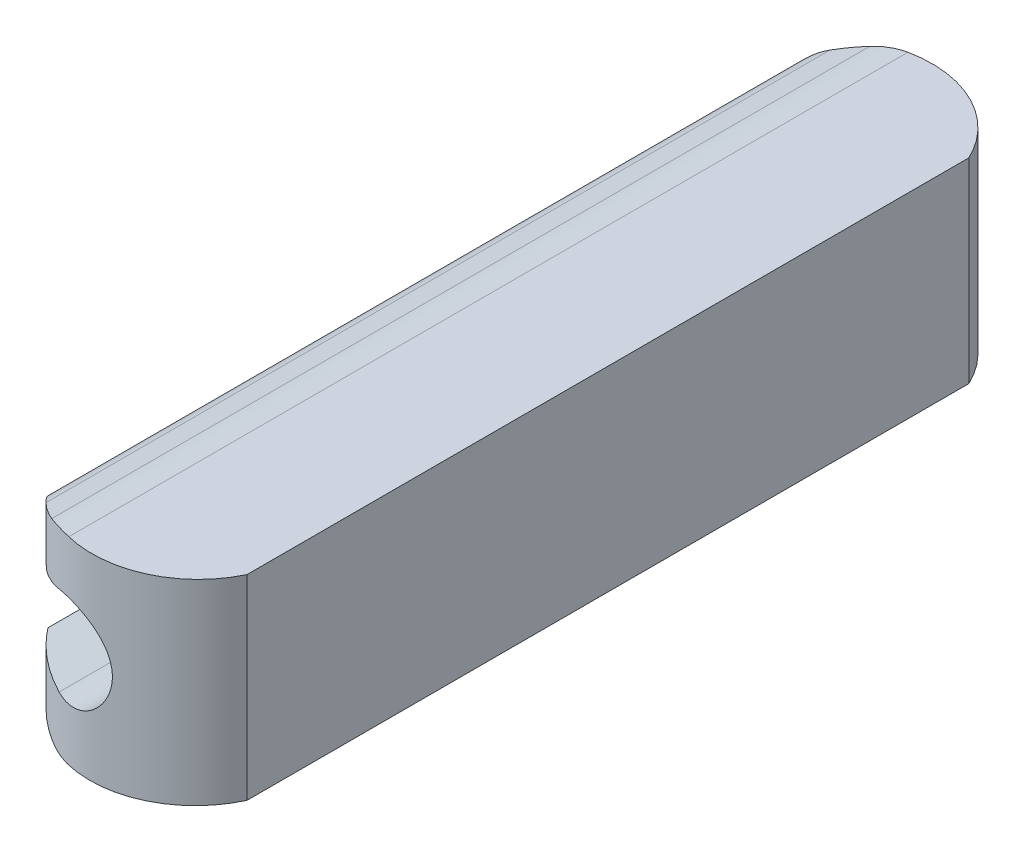
ISO-10303-21;
HEADER;
FILE_DESCRIPTION(('STEP AP214'),'2;1');
FILE_NAME('part.step','',(''),(''),'','','');
FILE_SCHEMA(('AUTOMOTIVE_DESIGN { 1 0 10303 214 1 1 1 1 }'));
ENDSEC;
DATA;
#1=APPLICATION_CONTEXT('core data for automotive mechanical design processes');
#2=APPLICATION_PROTOCOL_DEFINITION('international standard','automotive_design',2000,#1);
#3=PRODUCT_CONTEXT('',#1,'mechanical');
#4=PRODUCT('Part','Part','',(#3));
#5=PRODUCT_RELATED_PRODUCT_CATEGORY('part','',(#4));
#6=PRODUCT_DEFINITION_FORMATION('','',#4);
#7=PRODUCT_DEFINITION_CONTEXT('part definition',#1,'design');
#8=PRODUCT_DEFINITION('design','',#6,#7);
#9=PRODUCT_DEFINITION_SHAPE('','',#8);
#10=(LENGTH_UNIT() NAMED_UNIT(*) SI_UNIT(.MILLI.,.METRE.));
#11=(NAMED_UNIT(*) PLANE_ANGLE_UNIT() SI_UNIT($,.RADIAN.));
#12=(NAMED_UNIT(*) SI_UNIT($,.STERADIAN.) SOLID_ANGLE_UNIT());
#13=UNCERTAINTY_MEASURE_WITH_UNIT(LENGTH_MEASURE(1.E-05),#10,'distance_accuracy_value','');
#14=(GEOMETRIC_REPRESENTATION_CONTEXT(3) GLOBAL_UNCERTAINTY_ASSIGNED_CONTEXT((#13)) GLOBAL_UNIT_ASSIGNED_CONTEXT((#10,
#11,#12)) REPRESENTATION_CONTEXT('',''));
#15=CARTESIAN_POINT('',(0.,0.,0.));
#16=DIRECTION('',(0.,0.,1.));
#17=DIRECTION('',(1.,0.,0.));
#18=AXIS2_PLACEMENT_3D('',#15,#16,#17);
#19=CARTESIAN_POINT('',(-2.45293322950602,-1.69036477014939,16.));
#20=DIRECTION('',(-0.258821432514505,-0.965925186580793,0.));
#21=DIRECTION('',(0.965925186580793,-0.258821432514505,0.));
#22=AXIS2_PLACEMENT_3D('',#19,#20,#21);
#23=PLANE('',#22);
#24=DIRECTION('',(0.,0.,-1.));
#25=VECTOR('',#24,1.);
#26=CARTESIAN_POINT('',(-2.45293322950602,-1.69036477014939,16.));
#27=LINE('',#26,#25);
#28=CARTESIAN_POINT('',(-2.45293322950602,-1.69036477014939,15.7388461950632));
#29=VERTEX_POINT('',#28);
#30=CARTESIAN_POINT('',(-2.45293322950602,-1.69036477014939,-15.7388461950631));
#31=VERTEX_POINT('',#30);
#32=EDGE_CURVE('E170',#29,#31,#27,.T.);
#33=ORIENTED_EDGE('',*,*,#32,.T.);
#34=CARTESIAN_POINT('',(-1.030884728903,-2.07140528461618,-11.9977162722063));
#35=DIRECTION('',(-0.258821432514505,-0.965925186580793,0.));
#36=DIRECTION('',(-0.965925186580793,0.258821432514505,0.));
#37=AXIS2_PLACEMENT_3D('',#34,#35,#36);
#38=ELLIPSE('',#37,4.14347175474436,4.00228372779369);
#39=CARTESIAN_POINT('',(-4.28299140657226,-1.19999731151645,-14.3305422826111));
#40=VERTEX_POINT('',#39);
#41=EDGE_CURVE('E273',#31,#40,#38,.F.);
#42=ORIENTED_EDGE('',*,*,#41,.T.);
#43=DIRECTION('',(0.,0.,-1.));
#44=VECTOR('',#43,1.);
#45=CARTESIAN_POINT('',(-4.28299140657226,-1.19999731151645,16.));
#46=LINE('',#45,#44);
#47=CARTESIAN_POINT('',(-4.28299140657226,-1.19999731151645,14.3305422826111));
#48=VERTEX_POINT('',#47);
#49=EDGE_CURVE('E190',#48,#40,#46,.T.);
#50=ORIENTED_EDGE('',*,*,#49,.F.);
#51=CARTESIAN_POINT('',(-1.030884728903,-2.07140528461618,11.9977162722063));
#52=DIRECTION('',(-0.258821432514505,-0.965925186580793,0.));
#53=DIRECTION('',(-0.965925186580793,0.258821432514505,0.));
#54=AXIS2_PLACEMENT_3D('',#51,#52,#53);
#55=ELLIPSE('',#54,4.14347175474436,4.00228372779369);
#56=EDGE_CURVE('E320',#48,#29,#55,.F.);
#57=ORIENTED_EDGE('',*,*,#56,.T.);
#58=EDGE_LOOP('',(#33,#42,#50,#57));
#59=FACE_BOUND('',#58,.T.);
#60=ADVANCED_FACE('F38',(#59),#23,.F.);
#61=CARTESIAN_POINT('',(-4.80063427160127,-3.13184768467804,16.));
#62=DIRECTION('',(-0.965925186580793,0.258821432514504,0.));
#63=DIRECTION('',(-0.258821432514505,-0.965925186580793,0.));
#64=AXIS2_PLACEMENT_3D('',#61,#62,#63);
#65=PLANE('',#64);
#66=CARTESIAN_POINT('',(-1.030884728903,10.9369100492458,-11.9977162722063));
#67=DIRECTION('',(-0.965925186580793,0.258821432514504,0.));
#68=DIRECTION('',(0.258821432514505,0.965925186580793,0.));
#69=AXIS2_PLACEMENT_3D('',#66,#67,#68);
#70=ELLIPSE('',#69,15.4634942280887,4.00228372779369);
#71=CARTESIAN_POINT('',(-4.54181283908676,-2.16592249809725,-13.9190852744762));
#72=VERTEX_POINT('',#71);
#73=EDGE_CURVE('E271',#72,#40,#70,.F.);
#74=ORIENTED_EDGE('',*,*,#73,.F.);
#75=DIRECTION('',(0.,0.,-1.));
#76=VECTOR('',#75,1.);
#77=CARTESIAN_POINT('',(-4.54181283908676,-2.16592249809725,16.));
#78=LINE('',#77,#76);
#79=CARTESIAN_POINT('',(-4.54181283908676,-2.16592249809725,13.9190852744762));
#80=VERTEX_POINT('',#79);
#81=EDGE_CURVE('E196',#72,#80,#78,.F.);
#82=ORIENTED_EDGE('',*,*,#81,.T.);
#83=CARTESIAN_POINT('',(-1.030884728903,10.9369100492458,11.9977162722063));
#84=DIRECTION('',(-0.965925186580793,0.258821432514504,0.));
#85=DIRECTION('',(0.258821432514505,0.965925186580793,0.));
#86=AXIS2_PLACEMENT_3D('',#83,#84,#85);
#87=ELLIPSE('',#86,15.4634942280887,4.00228372779369);
#88=EDGE_CURVE('E322',#48,#80,#87,.F.);
#89=ORIENTED_EDGE('',*,*,#88,.F.);
#90=ORIENTED_EDGE('',*,*,#49,.T.);
#91=EDGE_LOOP('',(#74,#82,#89,#90));
#92=FACE_BOUND('',#91,.T.);
#93=ADVANCED_FACE('F338',(#92),#65,.T.);
#94=CARTESIAN_POINT('',(-2.97057609453502,-3.62221514331097,16.));
#95=DIRECTION('',(-0.258821432514505,-0.965925186580793,0.));
#96=DIRECTION('',(0.965925186580793,-0.258821432514505,0.));
#97=AXIS2_PLACEMENT_3D('',#94,#95,#96);
#98=PLANE('',#97);
#99=CARTESIAN_POINT('',(-1.030884728903,-4.14195901671178,-11.9977162722063));
#100=DIRECTION('',(-0.258821432514505,-0.965925186580793,0.));
#101=DIRECTION('',(-0.965925186580793,0.258821432514505,0.));
#102=AXIS2_PLACEMENT_3D('',#99,#100,#101);
#103=ELLIPSE('',#102,4.14347175474436,4.00228372779369);
#104=CARTESIAN_POINT('',(-2.97057609453502,-3.62221514331097,-15.49855509224));
#105=VERTEX_POINT('',#104);
#106=CARTESIAN_POINT('',(-3.83470908502047,-3.39066911719254,-14.8537351828238));
#107=VERTEX_POINT('',#106);
#108=EDGE_CURVE('E262',#105,#107,#103,.F.);
#109=ORIENTED_EDGE('',*,*,#108,.F.);
#110=DIRECTION('',(0.,0.,-1.));
#111=VECTOR('',#110,1.);
#112=CARTESIAN_POINT('',(-2.97057609453502,-3.62221514331097,16.));
#113=LINE('',#112,#111);
#114=CARTESIAN_POINT('',(-2.97057609453502,-3.62221514331097,15.49855509224));
#115=VERTEX_POINT('',#114);
#116=EDGE_CURVE('E187',#115,#105,#113,.T.);
#117=ORIENTED_EDGE('',*,*,#116,.F.);
#118=CARTESIAN_POINT('',(-1.030884728903,-4.14195901671178,11.9977162722063));
#119=DIRECTION('',(-0.258821432514505,-0.965925186580793,0.));
#120=DIRECTION('',(-0.965925186580793,0.258821432514505,0.));
#121=AXIS2_PLACEMENT_3D('',#118,#119,#120);
#122=ELLIPSE('',#121,4.14347175474436,4.00228372779369);
#123=CARTESIAN_POINT('',(-3.83470908502047,-3.39066911719254,14.8537351828238));
#124=VERTEX_POINT('',#123);
#125=EDGE_CURVE('E244',#124,#115,#122,.F.);
#126=ORIENTED_EDGE('',*,*,#125,.F.);
#127=DIRECTION('',(0.,0.,-1.));
#128=VECTOR('',#127,1.);
#129=CARTESIAN_POINT('',(-3.83470908502047,-3.39066911719254,16.));
#130=LINE('',#129,#128);
#131=EDGE_CURVE('E193',#124,#107,#130,.T.);
#132=ORIENTED_EDGE('',*,*,#131,.T.);
#133=EDGE_LOOP('',(#109,#117,#126,#132));
#134=FACE_BOUND('',#133,.T.);
#135=ADVANCED_FACE('F291',(#134),#98,.T.);
#136=CARTESIAN_POINT('',(-2.97057609453502,3.62222052027807,16.));
#137=DIRECTION('',(-0.258821432514505,0.965925186580793,0.));
#138=DIRECTION('',(-0.965925186580793,-0.258821432514505,0.));
#139=AXIS2_PLACEMENT_3D('',#136,#137,#138);
#140=PLANE('',#139);
#141=CARTESIAN_POINT('',(-1.030884728903,4.14196439367887,-11.9977162722063));
#142=DIRECTION('',(-0.258821432514505,0.965925186580793,0.));
#143=DIRECTION('',(0.965925186580793,0.258821432514505,0.));
#144=AXIS2_PLACEMENT_3D('',#141,#142,#143);
#145=ELLIPSE('',#144,4.14347175474436,4.00228372779369);
#146=CARTESIAN_POINT('',(-3.83470908502047,3.39067449415964,-14.8537351828238));
#147=VERTEX_POINT('',#146);
#148=CARTESIAN_POINT('',(-2.97057499451313,3.62222081503063,-15.4985557017231));
#149=VERTEX_POINT('',#148);
#150=EDGE_CURVE('E309',#147,#149,#145,.F.);
#151=ORIENTED_EDGE('',*,*,#150,.F.);
#152=DIRECTION('',(0.,0.,-1.));
#153=VECTOR('',#152,1.);
#154=CARTESIAN_POINT('',(-3.83470908502047,3.39067449415964,16.));
#155=LINE('',#154,#153);
#156=CARTESIAN_POINT('',(-3.83470908502047,3.39067449415964,14.8537351828238));
#157=VERTEX_POINT('',#156);
#158=EDGE_CURVE('E202',#147,#157,#155,.F.);
#159=ORIENTED_EDGE('',*,*,#158,.T.);
#160=CARTESIAN_POINT('',(-1.030884728903,4.14196439367887,11.9977162722063));
#161=DIRECTION('',(-0.258821432514505,0.965925186580793,0.));
#162=DIRECTION('',(0.965925186580793,0.258821432514505,0.));
#163=AXIS2_PLACEMENT_3D('',#160,#161,#162);
#164=ELLIPSE('',#163,4.14347175474436,4.00228372779369);
#165=CARTESIAN_POINT('',(-2.97057499451313,3.62222081503063,15.4985557017231));
#166=VERTEX_POINT('',#165);
#167=EDGE_CURVE('E66',#166,#157,#164,.F.);
#168=ORIENTED_EDGE('',*,*,#167,.F.);
#169=DIRECTION('',(0.,0.,-1.));
#170=VECTOR('',#169,1.);
#171=CARTESIAN_POINT('',(-2.97057499451313,3.62222081503063,16.));
#172=LINE('',#171,#170);
#173=EDGE_CURVE('E184',#166,#149,#172,.T.);
#174=ORIENTED_EDGE('',*,*,#173,.T.);
#175=EDGE_LOOP('',(#151,#159,#168,#174));
#176=FACE_BOUND('',#175,.T.);
#177=ADVANCED_FACE('F289',(#176),#140,.T.);
#178=CARTESIAN_POINT('',(-4.28299140657226,1.20000268848355,16.));
#179=DIRECTION('',(-0.965925186580793,-0.258821432514504,0.));
#180=DIRECTION('',(0.258821432514504,-0.965925186580793,0.));
#181=AXIS2_PLACEMENT_3D('',#178,#179,#180);
#182=PLANE('',#181);
#183=CARTESIAN_POINT('',(-1.030884728903,-10.9369046722787,-11.9977162722063));
#184=DIRECTION('',(-0.965925186580793,-0.258821432514504,0.));
#185=DIRECTION('',(-0.258821432514504,0.965925186580793,0.));
#186=AXIS2_PLACEMENT_3D('',#183,#184,#185);
#187=ELLIPSE('',#186,15.4634942280887,4.00228372779369);
#188=CARTESIAN_POINT('',(-4.28299140657226,1.20000268848355,-14.3305422826111));
#189=VERTEX_POINT('',#188);
#190=CARTESIAN_POINT('',(-4.54181283908676,2.16592787506434,-13.9190852744762));
#191=VERTEX_POINT('',#190);
#192=EDGE_CURVE('E58',#189,#191,#187,.F.);
#193=ORIENTED_EDGE('',*,*,#192,.F.);
#194=DIRECTION('',(0.,0.,-1.));
#195=VECTOR('',#194,1.);
#196=CARTESIAN_POINT('',(-4.28299140657226,1.20000268848355,16.));
#197=LINE('',#196,#195);
#198=CARTESIAN_POINT('',(-4.28299140657226,1.20000268848355,14.3305422826111));
#199=VERTEX_POINT('',#198);
#200=EDGE_CURVE('E181',#199,#189,#197,.T.);
#201=ORIENTED_EDGE('',*,*,#200,.F.);
#202=CARTESIAN_POINT('',(-1.030884728903,-10.9369046722787,11.9977162722063));
#203=DIRECTION('',(-0.965925186580793,-0.258821432514504,0.));
#204=DIRECTION('',(-0.258821432514504,0.965925186580793,0.));
#205=AXIS2_PLACEMENT_3D('',#202,#203,#204);
#206=ELLIPSE('',#205,15.4634942280887,4.00228372779369);
#207=CARTESIAN_POINT('',(-4.54181283908676,2.16592787506434,13.9190852744762));
#208=VERTEX_POINT('',#207);
#209=EDGE_CURVE('E346',#208,#199,#206,.F.);
#210=ORIENTED_EDGE('',*,*,#209,.F.);
#211=DIRECTION('',(0.,0.,-1.));
#212=VECTOR('',#211,1.);
#213=CARTESIAN_POINT('',(-4.54181283908676,2.16592787506434,16.));
#214=LINE('',#213,#212);
#215=EDGE_CURVE('E199',#208,#191,#214,.T.);
#216=ORIENTED_EDGE('',*,*,#215,.T.);
#217=EDGE_LOOP('',(#193,#201,#210,#216));
#218=FACE_BOUND('',#217,.T.);
#219=ADVANCED_FACE('F355',(#218),#182,.T.);
#220=CARTESIAN_POINT('',(-2.45293322950602,1.69037014711648,16.));
#221=DIRECTION('',(-0.258821432514505,0.965925186580793,0.));
#222=DIRECTION('',(-0.965925186580793,-0.258821432514505,0.));
#223=AXIS2_PLACEMENT_3D('',#220,#221,#222);
#224=PLANE('',#223);
#225=ORIENTED_EDGE('',*,*,#200,.T.);
#226=CARTESIAN_POINT('',(-1.030884728903,2.07141066158327,-11.9977162722063));
#227=DIRECTION('',(-0.258821432514505,0.965925186580793,0.));
#228=DIRECTION('',(0.965925186580793,0.258821432514505,0.));
#229=AXIS2_PLACEMENT_3D('',#226,#227,#228);
#230=ELLIPSE('',#229,4.14347175474436,4.00228372779369);
#231=CARTESIAN_POINT('',(-2.45293322950602,1.69037014711648,-15.7388461950631));
#232=VERTEX_POINT('',#231);
#233=EDGE_CURVE('E308',#189,#232,#230,.F.);
#234=ORIENTED_EDGE('',*,*,#233,.T.);
#235=DIRECTION('',(0.,0.,-1.));
#236=VECTOR('',#235,1.);
#237=CARTESIAN_POINT('',(-2.45293322950602,1.69037014711648,16.));
#238=LINE('',#237,#236);
#239=CARTESIAN_POINT('',(-2.45293322950602,1.69037014711648,15.7388461950632));
#240=VERTEX_POINT('',#239);
#241=EDGE_CURVE('E178',#240,#232,#238,.T.);
#242=ORIENTED_EDGE('',*,*,#241,.F.);
#243=CARTESIAN_POINT('',(-1.030884728903,2.07141066158327,11.9977162722063));
#244=DIRECTION('',(-0.258821432514505,0.965925186580793,0.));
#245=DIRECTION('',(0.965925186580793,0.258821432514505,0.));
#246=AXIS2_PLACEMENT_3D('',#243,#244,#245);
#247=ELLIPSE('',#246,4.14347175474436,4.00228372779369);
#248=EDGE_CURVE('E245',#240,#199,#247,.F.);
#249=ORIENTED_EDGE('',*,*,#248,.T.);
#250=EDGE_LOOP('',(#225,#234,#242,#249));
#251=FACE_BOUND('',#250,.T.);
#252=ADVANCED_FACE('F354',(#251),#224,.F.);
#253=CARTESIAN_POINT('',(0.,-3.74999536955267,16.));
#254=DIRECTION('',(0.,-1.,0.));
#255=DIRECTION('',(1.,0.,0.));
#256=AXIS2_PLACEMENT_3D('',#253,#254,#255);
#257=PLANE('',#256);
#258=CARTESIAN_POINT('',(-1.030884728903,-3.74999536955275,-11.9977162722063));
#259=DIRECTION('',(0.,-1.,0.));
#260=DIRECTION('',(0.,0.,-1.));
#261=AXIS2_PLACEMENT_3D('',#258,#259,#260);
#262=CIRCLE('',#261,4.00228372779369);
#263=CARTESIAN_POINT('',(-1.99999718774555,-3.74999536955275,-15.8808974526148));
#264=VERTEX_POINT('',#263);
#265=CARTESIAN_POINT('',(2.60276571840215,-3.74999536955275,-13.6754705642769));
#266=VERTEX_POINT('',#265);
#267=EDGE_CURVE('E153',#264,#266,#262,.T.);
#268=ORIENTED_EDGE('',*,*,#267,.T.);
#269=DIRECTION('',(0.,0.,-1.));
#270=VECTOR('',#269,1.);
#271=CARTESIAN_POINT('',(2.60276571840215,-3.74999536955267,16.));
#272=LINE('',#271,#270);
#273=CARTESIAN_POINT('',(2.60276571840215,-3.74999536955275,13.6754705642769));
#274=VERTEX_POINT('',#273);
#275=EDGE_CURVE('E160',#274,#266,#272,.T.);
#276=ORIENTED_EDGE('',*,*,#275,.F.);
#277=CARTESIAN_POINT('',(-1.030884728903,-3.74999536955275,11.9977162722063));
#278=DIRECTION('',(0.,-1.,0.));
#279=DIRECTION('',(0.,0.,1.));
#280=AXIS2_PLACEMENT_3D('',#277,#278,#279);
#281=CIRCLE('',#280,4.00228372779369);
#282=CARTESIAN_POINT('',(-1.99999718774555,-3.74999536955275,15.8808974526148));
#283=VERTEX_POINT('',#282);
#284=EDGE_CURVE('E142',#274,#283,#281,.T.);
#285=ORIENTED_EDGE('',*,*,#284,.T.);
#286=DIRECTION('',(0.,0.,-1.));
#287=VECTOR('',#286,1.);
#288=CARTESIAN_POINT('',(-1.99999718774555,-3.74999536955267,16.));
#289=LINE('',#288,#287);
#290=EDGE_CURVE('E168',#283,#264,#289,.T.);
#291=ORIENTED_EDGE('',*,*,#290,.T.);
#292=EDGE_LOOP('',(#268,#276,#285,#291));
#293=FACE_BOUND('',#292,.T.);
#294=ADVANCED_FACE('F167',(#293),#257,.T.);
#295=CARTESIAN_POINT('',(0.0733858378657422,3.709718651575,16.));
#296=DIRECTION('',(-0.0197781799508234,-0.999804392667802,0.));
#297=DIRECTION('',(0.999804392667802,-0.0197781799508234,0.));
#298=AXIS2_PLACEMENT_3D('',#295,#296,#297);
#299=PLANE('',#298);
#300=DIRECTION('',(0.,0.,-1.));
#301=VECTOR('',#300,1.);
#302=CARTESIAN_POINT('',(2.60276571840215,3.6596823336631,16.));
#303=LINE('',#302,#301);
#304=CARTESIAN_POINT('',(2.60276571840215,3.6596823336631,13.6754705642769));
#305=VERTEX_POINT('',#304);
#306=CARTESIAN_POINT('',(2.60276571840215,3.6596823336631,-13.6754705642769));
#307=VERTEX_POINT('',#306);
#308=EDGE_CURVE('E162',#305,#307,#303,.T.);
#309=ORIENTED_EDGE('',*,*,#308,.T.);
#310=CARTESIAN_POINT('',(-1.030884728903,3.73156338654928,-11.9977162722063));
#311=DIRECTION('',(-0.0197781799508234,-0.999804392667802,0.));
#312=DIRECTION('',(-0.999804392667802,0.0197781799508234,0.));
#313=AXIS2_PLACEMENT_3D('',#310,#311,#312);
#314=ELLIPSE('',#313,4.00306675700264,4.00228372779369);
#315=CARTESIAN_POINT('',(-1.92582905133847,3.74926721940396,-15.8986584273148));
#316=VERTEX_POINT('',#315);
#317=EDGE_CURVE('E313',#307,#316,#314,.F.);
#318=ORIENTED_EDGE('',*,*,#317,.T.);
#319=DIRECTION('',(0.,0.,-1.));
#320=VECTOR('',#319,1.);
#321=CARTESIAN_POINT('',(-1.92582905133847,3.74926721940389,16.));
#322=LINE('',#321,#320);
#323=CARTESIAN_POINT('',(-1.92582905133847,3.74926721940396,15.8986584273148));
#324=VERTEX_POINT('',#323);
#325=EDGE_CURVE('E172',#324,#316,#322,.T.);
#326=ORIENTED_EDGE('',*,*,#325,.F.);
#327=CARTESIAN_POINT('',(-1.030884728903,3.73156338654928,11.9977162722063));
#328=DIRECTION('',(-0.0197781799508234,-0.999804392667802,0.));
#329=DIRECTION('',(-0.999804392667802,0.0197781799508234,0.));
#330=AXIS2_PLACEMENT_3D('',#327,#328,#329);
#331=ELLIPSE('',#330,4.00306675700264,4.00228372779369);
#332=EDGE_CURVE('E164',#324,#305,#331,.F.);
#333=ORIENTED_EDGE('',*,*,#332,.T.);
#334=EDGE_LOOP('',(#309,#318,#326,#333));
#335=FACE_BOUND('',#334,.T.);
#336=ADVANCED_FACE('F214',(#335),#299,.F.);
#337=CARTESIAN_POINT('',(-1.99999718774555,2.68848354670792E-06,16.));
#338=DIRECTION('',(0.,0.,-1.));
#339=DIRECTION('',(-1.,0.,0.));
#340=AXIS2_PLACEMENT_3D('',#337,#338,#339);
#341=CYLINDRICAL_SURFACE('',#340,3.7499980580363);
#342=CARTESIAN_POINT('',(-1.99999718774555,-3.74999536955275,-15.8808974526148));
#343=CARTESIAN_POINT('',(-2.08575228189416,-3.7500113364589,-15.859514687352));
#344=CARTESIAN_POINT('',(-2.17076027349519,-3.74705452271607,-15.8352639264582));
#345=CARTESIAN_POINT('',(-2.33803142329213,-3.73565805022022,-15.781532231521));
#346=CARTESIAN_POINT('',(-2.42031036239841,-3.72725959030275,-15.7520917979917));
#347=CARTESIAN_POINT('',(-2.58216103520052,-3.70543182184758,-15.6881625878047));
#348=CARTESIAN_POINT('',(-2.66173322552486,-3.6920033665075,-15.6536746679155));
#349=CARTESIAN_POINT('',(-2.81834556260527,-3.66049371823136,-15.5797315005388));
#350=CARTESIAN_POINT('',(-2.89536209095974,-3.64237820352151,-15.5402407565357));
#351=CARTESIAN_POINT('',(-2.97057609453506,-3.62221514331112,-15.49855509224));
#352=B_SPLINE_CURVE_WITH_KNOTS('',3,(#342,#343,#344,#345,#346,#347,#348,#349,#350,#351),
.UNSPECIFIED.,.F.,.F.,(4,2,2,2,4),(0.,0.264998894754735,0.528014556403104,0.790985625010632,
1.05593970592983),.UNSPECIFIED.);
#353=EDGE_CURVE('E276',#264,#105,#352,.T.);
#354=ORIENTED_EDGE('',*,*,#353,.F.);
#355=ORIENTED_EDGE('',*,*,#290,.F.);
#356=CARTESIAN_POINT('',(-2.97057609453506,-3.62221514331112,15.49855509224));
#357=CARTESIAN_POINT('',(-2.89536209095974,-3.64237820352151,15.5402407565357));
#358=CARTESIAN_POINT('',(-2.81834556260527,-3.66049371823136,15.5797315005388));
#359=CARTESIAN_POINT('',(-2.66173322552486,-3.6920033665075,15.6536746679155));
#360=CARTESIAN_POINT('',(-2.58216103520052,-3.70543182184758,15.6881625878047));
#361=CARTESIAN_POINT('',(-2.42031036239841,-3.72725959030275,15.7520917979917));
#362=CARTESIAN_POINT('',(-2.33803142329213,-3.73565805022022,15.781532231521));
#363=CARTESIAN_POINT('',(-2.17076027349519,-3.74705452271607,15.8352639264582));
#364=CARTESIAN_POINT('',(-2.08575228189416,-3.7500113364589,15.859514687352));
#365=CARTESIAN_POINT('',(-1.99999718774555,-3.74999536955275,15.8808974526148));
#366=B_SPLINE_CURVE_WITH_KNOTS('',3,(#356,#357,#358,#359,#360,#361,#362,#363,#364,#365),
.UNSPECIFIED.,.F.,.F.,(4,2,2,2,4),(0.,0.2649540809192,0.527925149526728,0.790940811175095,
1.05593970592983),.UNSPECIFIED.);
#367=EDGE_CURVE('E148',#115,#283,#366,.T.);
#368=ORIENTED_EDGE('',*,*,#367,.F.);
#369=ORIENTED_EDGE('',*,*,#116,.T.);
#370=EDGE_LOOP('',(#354,#355,#368,#369));
#371=FACE_BOUND('',#370,.T.);
#372=ADVANCED_FACE('F287',(#371),#341,.T.);
#373=CARTESIAN_POINT('',(-2.97057499451313,3.62222081503063,-15.4985557017231));
#374=CARTESIAN_POINT('',(-2.88988851884182,3.6438536075663,-15.5432778691023));
#375=CARTESIAN_POINT('',(-2.80712000587584,3.66312787703783,-15.5854728629984));
#376=CARTESIAN_POINT('',(-2.63870875349587,3.69619170563301,-15.6640098538193));
#377=CARTESIAN_POINT('',(-2.55309727156406,3.71002750730656,-15.70039956261));
#378=CARTESIAN_POINT('',(-2.37884915037511,3.73184639310836,-15.7673274314034));
#379=CARTESIAN_POINT('',(-2.29021189344988,3.73982827467581,-15.7978643881341));
#380=CARTESIAN_POINT('',(-2.10991819175405,3.74949179532305,-15.8529696045095));
#381=CARTESIAN_POINT('',(-2.01824208222298,3.75111755051414,-15.8774831529747));
#382=CARTESIAN_POINT('',(-1.92582905133847,3.74926721940396,-15.8986584273148));
#383=B_SPLINE_CURVE_WITH_KNOTS('',3,(#373,#374,#375,#376,#377,#378,#379,#380,#381,#382),
.UNSPECIFIED.,.F.,.F.,(4,2,2,2,4),(0.,0.284238888640319,0.566005757874163,0.847830493793274,
1.1321275701048),.UNSPECIFIED.);
#384=EDGE_CURVE('E301',#149,#316,#383,.T.);
#385=ORIENTED_EDGE('',*,*,#384,.F.);
#386=ORIENTED_EDGE('',*,*,#173,.F.);
#387=CARTESIAN_POINT('',(-1.92582905133847,3.74926721940396,15.8986584273148));
#388=CARTESIAN_POINT('',(-2.01824208222298,3.75111755051414,15.8774831529747));
#389=CARTESIAN_POINT('',(-2.10991819175405,3.74949179532305,15.8529696045095));
#390=CARTESIAN_POINT('',(-2.29021189344988,3.73982827467581,15.7978643881341));
#391=CARTESIAN_POINT('',(-2.37884915037511,3.73184639310836,15.7673274314034));
#392=CARTESIAN_POINT('',(-2.55309727156406,3.71002750730656,15.70039956261));
#393=CARTESIAN_POINT('',(-2.63870875349587,3.69619170563301,15.6640098538193));
#394=CARTESIAN_POINT('',(-2.80712000587584,3.66312787703783,15.5854728629984));
#395=CARTESIAN_POINT('',(-2.88988851884182,3.6438536075663,15.5432778691023));
#396=CARTESIAN_POINT('',(-2.97057499451313,3.62222081503063,15.4985557017231));
#397=B_SPLINE_CURVE_WITH_KNOTS('',3,(#387,#388,#389,#390,#391,#392,#393,#394,#395,#396),
.UNSPECIFIED.,.F.,.F.,(4,2,2,2,4),(0.,0.284297076311523,0.566121812230634,0.847888681464477,
1.1321275701048),.UNSPECIFIED.);
#398=EDGE_CURVE('E222',#324,#166,#397,.T.);
#399=ORIENTED_EDGE('',*,*,#398,.F.);
#400=ORIENTED_EDGE('',*,*,#325,.T.);
#401=EDGE_LOOP('',(#385,#386,#399,#400));
#402=FACE_BOUND('',#401,.T.);
#403=ADVANCED_FACE('F281',(#402),#341,.T.);
#404=CARTESIAN_POINT('',(-1.99999718774555,2.68848354670792E-06,16.));
#405=DIRECTION('',(0.,0.,-1.));
#406=DIRECTION('',(-1.,0.,0.));
#407=AXIS2_PLACEMENT_3D('',#404,#405,#406);
#408=CYLINDRICAL_SURFACE('',#407,1.7499980580363);
#409=ORIENTED_EDGE('',*,*,#241,.T.);
#410=CARTESIAN_POINT('',(-2.45293322950602,1.69037014711648,-15.7388461950632));
#411=CARTESIAN_POINT('',(-2.40947616231862,1.70201282000994,-15.7553671266546));
#412=CARTESIAN_POINT('',(-2.36536355892049,1.71203677797308,-15.7712646269125));
#413=CARTESIAN_POINT('',(-2.2760150016433,1.728695142162,-15.8016818256895));
#414=CARTESIAN_POINT('',(-2.2307785291928,1.73532795201225,-15.8162008726907));
#415=CARTESIAN_POINT('',(-2.09370101823686,1.74989982527703,-15.8574791986698));
#416=CARTESIAN_POINT('',(-2.00051740144378,1.75250537836398,-15.8819498933717));
#417=CARTESIAN_POINT('',(-1.81311781534035,1.74253121284984,-15.9239926639164));
#418=CARTESIAN_POINT('',(-1.71889956367207,1.72990513778091,-15.9415434633813));
#419=CARTESIAN_POINT('',(-1.53288096734242,1.68918621441179,-15.9695049035471));
#420=CARTESIAN_POINT('',(-1.4410775858084,1.66111387144292,-15.9799249694275));
#421=CARTESIAN_POINT('',(-1.26702338866354,1.59173688744482,-15.9939391927525));
#422=CARTESIAN_POINT('',(-1.18452726410193,1.55110245627986,-15.9978260804001));
#423=CARTESIAN_POINT('',(-1.02682550366313,1.45734670716957,-16.0007761482736));
#424=CARTESIAN_POINT('',(-0.951624274635816,1.40421790690988,-15.9998364310084));
#425=CARTESIAN_POINT('',(-0.8093174346822,1.28588387022236,-15.9945088315238));
#426=CARTESIAN_POINT('',(-0.742377094321925,1.22048302732012,-15.990060713805));
#427=CARTESIAN_POINT('',(-0.619822109368743,1.07995914401661,-15.9793107326707));
#428=CARTESIAN_POINT('',(-0.564208532775998,1.00483518791455,-15.9730086945859));
#429=CARTESIAN_POINT('',(-0.463299989561277,0.842958002615447,-15.9598926428827));
#430=CARTESIAN_POINT('',(-0.418617858894432,0.755822683641738,-15.9530685141595));
#431=CARTESIAN_POINT('',(-0.344360530747043,0.575235028861775,-15.9408602113655));
#432=CARTESIAN_POINT('',(-0.314785814437687,0.481782491959443,-15.9354760831612));
#433=CARTESIAN_POINT('',(-0.271481859403842,0.290520218339105,-15.9273572231979));
#434=CARTESIAN_POINT('',(-0.257855199772028,0.192686431803869,-15.9246396608478));
#435=CARTESIAN_POINT('',(-0.247237532760858,-0.00390786046223566,-15.9225352203633));
#436=CARTESIAN_POINT('',(-0.250244538671093,-0.10266825411336,-15.9231479444623));
#437=CARTESIAN_POINT('',(-0.272587036157358,-0.296468712118606,-15.9275230174692));
#438=CARTESIAN_POINT('',(-0.291632834130352,-0.391543682049042,-15.9312294767406));
#439=CARTESIAN_POINT('',(-0.345091069667042,-0.57715344819577,-15.9408994141398));
#440=CARTESIAN_POINT('',(-0.379505646312738,-0.66768761045433,-15.9468632064336));
#441=CARTESIAN_POINT('',(-0.463161638354881,-0.842690884943185,-15.9597569896667));
#442=CARTESIAN_POINT('',(-0.512550831000325,-0.927088645029999,-15.9666962227722));
#443=CARTESIAN_POINT('',(-0.624718606213788,-1.08655409532266,-15.9797362500696));
#444=CARTESIAN_POINT('',(-0.687498718270331,-1.16162071819005,-15.9858369483545));
#445=CARTESIAN_POINT('',(-0.825507407565935,-1.30106820188767,-15.9953303305044));
#446=CARTESIAN_POINT('',(-0.900857340781638,-1.36533125796159,-15.998694526125));
#447=CARTESIAN_POINT('',(-1.06134968722476,-1.48025566648844,-16.0006862627049));
#448=CARTESIAN_POINT('',(-1.14648818432012,-1.53092243157742,-15.999315691582));
#449=CARTESIAN_POINT('',(-1.32048475473683,-1.61547199134618,-15.9904224391499));
#450=CARTESIAN_POINT('',(-1.40908286875975,-1.64991389652562,-15.9831328527929));
#451=CARTESIAN_POINT('',(-1.58994085667921,-1.70388909480428,-15.9618062545628));
#452=CARTESIAN_POINT('',(-1.68220054035809,-1.72342316129841,-15.9477695927787));
#453=CARTESIAN_POINT('',(-1.86393903653007,-1.74701801403,-15.9133959897707));
#454=CARTESIAN_POINT('',(-1.95339692442204,-1.75161581687856,-15.8933068053384));
#455=CARTESIAN_POINT('',(-2.13035736984316,-1.74737253413396,-15.8471033048749));
#456=CARTESIAN_POINT('',(-2.21786151655,-1.73854280706467,-15.8209940971067));
#457=CARTESIAN_POINT('',(-2.32863736267034,-1.71905365699092,-15.7838535686245));
#458=CARTESIAN_POINT('',(-2.35379848975327,-1.71404924090396,-15.7751334935713));
#459=CARTESIAN_POINT('',(-2.40368466651899,-1.70298848562102,-15.7572896852942));
#460=CARTESIAN_POINT('',(-2.42841048656521,-1.69693426662493,-15.7481667927681));
#461=CARTESIAN_POINT('',(-2.45293322950602,-1.69036477014939,-15.7388461950632));
#462=B_SPLINE_CURVE_WITH_KNOTS('',3,(#410,#411,#412,#413,#414,#415,#416,#417,#418,#419,#420,
#421,#422,#423,#424,#425,#426,#427,#428,#429,#430,#431,#432,#433,#434,#435,#436,#437,#438,#439,
#440,#441,#442,#443,#444,#445,#446,#447,#448,#449,#450,#451,#452,#453,#454,#455,#456,#457,#458,
#459,#460,#461),.UNSPECIFIED.,.F.,.F.,(4,2,2,2,2,2,2,2,2,2,2,2,2,2,2,2,2,2,2,2,2,2,2,2,2,4),(0.,
0.143712592153762,0.287492774547497,0.575136716602164,0.86365829722031,1.15179777865198,
1.42664417191469,1.70165557931599,1.98149421316661,2.26135922078915,2.55446798639053,
2.84758608692487,3.14257936020235,3.43753740050311,3.72727939743435,4.01706173427569,
4.30980239469529,4.60257650938761,4.89836087350379,5.19402731162061,5.47858435137858,
5.76312662776698,6.03731822610923,6.31127801116375,6.39254792175318,6.47365557031361),.UNSPECIFIED.);
#463=EDGE_CURVE('E264',#232,#31,#462,.T.);
#464=ORIENTED_EDGE('',*,*,#463,.T.);
#465=ORIENTED_EDGE('',*,*,#32,.F.);
#466=CARTESIAN_POINT('',(-2.45293322950602,-1.69036477014939,15.7388461950632));
#467=CARTESIAN_POINT('',(-2.40947616231862,-1.70200744304284,15.7553671266546));
#468=CARTESIAN_POINT('',(-2.36536355892049,-1.71203140100599,15.7712646269125));
#469=CARTESIAN_POINT('',(-2.2760150016433,-1.72868976519491,15.8016818256895));
#470=CARTESIAN_POINT('',(-2.2307785291928,-1.73532257504515,15.8162008726907));
#471=CARTESIAN_POINT('',(-2.09370101823686,-1.74989444830994,15.8574791986698));
#472=CARTESIAN_POINT('',(-2.00051740144378,-1.75250000139688,15.8819498933717));
#473=CARTESIAN_POINT('',(-1.81311781534035,-1.74252583588274,15.9239926639164));
#474=CARTESIAN_POINT('',(-1.71889956367207,-1.72989976081382,15.9415434633813));
#475=CARTESIAN_POINT('',(-1.53288096734242,-1.6891808374447,15.9695049035471));
#476=CARTESIAN_POINT('',(-1.4410775858084,-1.66110849447583,15.9799249694275));
#477=CARTESIAN_POINT('',(-1.26702338866354,-1.59173151047772,15.9939391927525));
#478=CARTESIAN_POINT('',(-1.18452726410193,-1.55109707931277,15.9978260804001));
#479=CARTESIAN_POINT('',(-1.02682550366313,-1.45734133020248,16.0007761482736));
#480=CARTESIAN_POINT('',(-0.951624274635816,-1.40421252994278,15.9998364310084));
#481=CARTESIAN_POINT('',(-0.8093174346822,-1.28587849325526,15.9945088315238));
#482=CARTESIAN_POINT('',(-0.742377094321925,-1.22047765035303,15.990060713805));
#483=CARTESIAN_POINT('',(-0.619822109368743,-1.07995376704952,15.9793107326707));
#484=CARTESIAN_POINT('',(-0.564208532775998,-1.00482981094746,15.9730086945859));
#485=CARTESIAN_POINT('',(-0.463299989561277,-0.842952625648354,15.9598926428827));
#486=CARTESIAN_POINT('',(-0.418617858894432,-0.755817306674645,15.9530685141595));
#487=CARTESIAN_POINT('',(-0.344360530747043,-0.575229651894682,15.9408602113655));
#488=CARTESIAN_POINT('',(-0.314785814437687,-0.48177711499235,15.9354760831612));
#489=CARTESIAN_POINT('',(-0.271481859403842,-0.290514841372012,15.9273572231979));
#490=CARTESIAN_POINT('',(-0.257855199772028,-0.192681054836776,15.9246396608478));
#491=CARTESIAN_POINT('',(-0.247237532760858,0.00391323742932901,15.9225352203633));
#492=CARTESIAN_POINT('',(-0.250244538671093,0.102673631080454,15.9231479444623));
#493=CARTESIAN_POINT('',(-0.272587036157358,0.296474089085699,15.9275230174692));
#494=CARTESIAN_POINT('',(-0.291632834130352,0.391549059016136,15.9312294767406));
#495=CARTESIAN_POINT('',(-0.345091069667042,0.577158825162863,15.9408994141398));
#496=CARTESIAN_POINT('',(-0.379505646312738,0.667692987421423,15.9468632064336));
#497=CARTESIAN_POINT('',(-0.463161638354881,0.842696261910278,15.9597569896667));
#498=CARTESIAN_POINT('',(-0.512550831000325,0.927094021997092,15.9666962227722));
#499=CARTESIAN_POINT('',(-0.624718606213789,1.08655947228976,15.9797362500696));
#500=CARTESIAN_POINT('',(-0.687498718270331,1.16162609515715,15.9858369483545));
#501=CARTESIAN_POINT('',(-0.825507407565936,1.30107357885476,15.9953303305044));
#502=CARTESIAN_POINT('',(-0.900857340781639,1.36533663492869,15.998694526125));
#503=CARTESIAN_POINT('',(-1.06134968722476,1.48026104345554,16.0006862627049));
#504=CARTESIAN_POINT('',(-1.14648818432012,1.53092780854451,15.999315691582));
#505=CARTESIAN_POINT('',(-1.32048475473683,1.61547736831328,15.9904224391499));
#506=CARTESIAN_POINT('',(-1.40908286875975,1.64991927349272,15.9831328527929));
#507=CARTESIAN_POINT('',(-1.58994085667921,1.70389447177137,15.9618062545628));
#508=CARTESIAN_POINT('',(-1.68220054035809,1.72342853826551,15.9477695927787));
#509=CARTESIAN_POINT('',(-1.86393903653007,1.74702339099709,15.9133959897707));
#510=CARTESIAN_POINT('',(-1.95339692442204,1.75162119384566,15.8933068053384));
#511=CARTESIAN_POINT('',(-2.13035736984317,1.74737791110106,15.8471033048749));
#512=CARTESIAN_POINT('',(-2.21786151655001,1.73854818403176,15.8209940971067));
#513=CARTESIAN_POINT('',(-2.32863736267034,1.71905903395801,15.7838535686245));
#514=CARTESIAN_POINT('',(-2.35379848975327,1.71405461787105,15.7751334935713));
#515=CARTESIAN_POINT('',(-2.40368466651898,1.70299386258811,15.7572896852942));
#516=CARTESIAN_POINT('',(-2.42841048656521,1.69693964359203,15.7481667927681));
#517=CARTESIAN_POINT('',(-2.45293322950602,1.69037014711648,15.7388461950632));
#518=B_SPLINE_CURVE_WITH_KNOTS('',3,(#466,#467,#468,#469,#470,#471,#472,#473,#474,#475,#476,
#477,#478,#479,#480,#481,#482,#483,#484,#485,#486,#487,#488,#489,#490,#491,#492,#493,#494,#495,
#496,#497,#498,#499,#500,#501,#502,#503,#504,#505,#506,#507,#508,#509,#510,#511,#512,#513,#514,
#515,#516,#517),.UNSPECIFIED.,.F.,.F.,(4,2,2,2,2,2,2,2,2,2,2,2,2,2,2,2,2,2,2,2,2,2,2,2,2,4),(0.,
0.143712592153762,0.287492774547497,0.575136716602164,0.86365829722031,1.15179777865198,
1.42664417191469,1.70165557931599,1.98149421316661,2.26135922078915,2.55446798639053,
2.84758608692487,3.14257936020235,3.43753740050311,3.72727939743435,4.01706173427569,
4.30980239469529,4.60257650938761,4.89836087350379,5.19402731162061,5.47858435137858,
5.76312662776698,6.03731822610923,6.31127801116375,6.39254792175318,6.47365557031361),.UNSPECIFIED.);
#519=EDGE_CURVE('E163',#29,#240,#518,.T.);
#520=ORIENTED_EDGE('',*,*,#519,.T.);
#521=EDGE_LOOP('',(#409,#464,#465,#520));
#522=FACE_BOUND('',#521,.T.);
#523=ADVANCED_FACE('F286',(#522),#408,.F.);
#524=CARTESIAN_POINT('',(2.60276571840215,0.,16.));
#525=DIRECTION('',(1.,0.,0.));
#526=DIRECTION('',(0.,1.,0.));
#527=AXIS2_PLACEMENT_3D('',#524,#525,#526);
#528=PLANE('',#527);
#529=DIRECTION('',(0.,1.,0.));
#530=VECTOR('',#529,1.);
#531=CARTESIAN_POINT('',(2.60276571840215,-3.74999536955275,-13.6754705642769));
#532=LINE('',#531,#530);
#533=EDGE_CURVE('E263',#307,#266,#532,.F.);
#534=ORIENTED_EDGE('',*,*,#533,.F.);
#535=ORIENTED_EDGE('',*,*,#308,.F.);
#536=DIRECTION('',(0.,1.,0.));
#537=VECTOR('',#536,1.);
#538=CARTESIAN_POINT('',(2.60276571840215,-3.74999536955275,13.6754705642769));
#539=LINE('',#538,#537);
#540=EDGE_CURVE('E145',#274,#305,#539,.T.);
#541=ORIENTED_EDGE('',*,*,#540,.F.);
#542=ORIENTED_EDGE('',*,*,#275,.T.);
#543=EDGE_LOOP('',(#534,#535,#541,#542));
#544=FACE_BOUND('',#543,.T.);
#545=ADVANCED_FACE('F159',(#544),#528,.T.);
#546=CARTESIAN_POINT('',(-3.57588765250597,-2.42474393061175,16.));
#547=DIRECTION('',(0.,0.,-1.));
#548=DIRECTION('',(-1.,0.,0.));
#549=AXIS2_PLACEMENT_3D('',#546,#547,#548);
#550=CYLINDRICAL_SURFACE('',#549,1.);
#551=CARTESIAN_POINT('',(-3.83470908502047,-3.39066911719254,-14.8537351828238));
#552=CARTESIAN_POINT('',(-3.87324934150154,-3.38032468815994,-14.815908591221));
#553=CARTESIAN_POINT('',(-3.91070469577678,-3.36783364972672,-14.7775969733751));
#554=CARTESIAN_POINT('',(-3.98333267013337,-3.33881522630596,-14.700330550147));
#555=CARTESIAN_POINT('',(-4.0185050232127,-3.32228737027644,-14.6613756701998));
#556=CARTESIAN_POINT('',(-4.08678673423074,-3.28526946031727,-14.5827651608234));
#557=CARTESIAN_POINT('',(-4.11987178017498,-3.26474122106541,-14.5431064241895));
#558=CARTESIAN_POINT('',(-4.18348148329437,-3.21994332930272,-14.4638859322796));
#559=CARTESIAN_POINT('',(-4.21400676395604,-3.19567459198259,-14.4243241556794));
#560=CARTESIAN_POINT('',(-4.28442819355651,-3.13258772330685,-14.3295563770695));
#561=CARTESIAN_POINT('',(-4.32302560846017,-3.09188716306052,-14.2745967589327));
#562=CARTESIAN_POINT('',(-4.37646994953507,-3.02464369082964,-14.1946159772542));
#563=CARTESIAN_POINT('',(-4.39352207632894,-3.00123402923111,-14.1684003398832));
#564=CARTESIAN_POINT('',(-4.42603739214201,-2.95210888804791,-14.1171807252386));
#565=CARTESIAN_POINT('',(-4.44150155688636,-2.92639484280781,-14.0921760089652));
#566=CARTESIAN_POINT('',(-4.47126124690461,-2.87120948571042,-14.0429415146412));
#567=CARTESIAN_POINT('',(-4.48547874922978,-2.84162466893188,-14.0187903312425));
#568=CARTESIAN_POINT('',(-4.51156289616501,-2.7792205253714,-13.9735284811748));
#569=CARTESIAN_POINT('',(-4.52343143333735,-2.74640383470388,-13.9524153705041));
#570=CARTESIAN_POINT('',(-4.5419794128597,-2.68451076075961,-13.9188559849641));
#571=CARTESIAN_POINT('',(-4.54922516605707,-2.6560962974667,-13.9055207661293));
#572=CARTESIAN_POINT('',(-4.5613610102017,-2.59719843591064,-13.8829689903226));
#573=CARTESIAN_POINT('',(-4.56625573455276,-2.56671924328377,-13.8737443348752));
#574=CARTESIAN_POINT('',(-4.57262887410388,-2.5095379295182,-13.8616805226067));
#575=CARTESIAN_POINT('',(-4.57454229349812,-2.48305864311066,-13.8580304184831));
#576=CARTESIAN_POINT('',(-4.57622917315946,-2.42978809453073,-13.8548139498732));
#577=CARTESIAN_POINT('',(-4.57600381586465,-2.40299701291881,-13.8552453289091));
#578=CARTESIAN_POINT('',(-4.5734404893096,-2.34995813859257,-13.8601288027897));
#579=CARTESIAN_POINT('',(-4.57110703561292,-2.32370930724235,-13.8645723036181));
#580=CARTESIAN_POINT('',(-4.56454116655992,-2.27230600867859,-13.8769701784106));
#581=CARTESIAN_POINT('',(-4.56030665646251,-2.24715278232402,-13.8849284250547));
#582=CARTESIAN_POINT('',(-4.55126540129416,-2.20330906631486,-13.901729323208));
#583=CARTESIAN_POINT('',(-4.54675721751354,-2.18435631706525,-13.9100503007432));
#584=CARTESIAN_POINT('',(-4.5418128390869,-2.16592249809721,-13.9190852744762));
#585=B_SPLINE_CURVE_WITH_KNOTS('',3,(#551,#552,#553,#554,#555,#556,#557,#558,#559,#560,#561,
#562,#563,#564,#565,#566,#567,#568,#569,#570,#571,#572,#573,#574,#575,#576,#577,#578,#579,#580,
#581,#582,#583,#584),.UNSPECIFIED.,.F.,.F.,(4,2,2,2,2,2,2,2,2,2,2,2,2,2,2,2,4),(0.,
0.164862042336457,0.32974333104031,0.496283247824178,0.662782481646624,0.897647185985264,
1.01475341834371,1.13178725856819,1.25381498217986,1.37574398413156,1.47206585029152,
1.56819709855125,1.6482209496869,1.72820056163823,1.80800926160026,1.8879061180496,
1.95131027321119),.UNSPECIFIED.);
#586=EDGE_CURVE('E255',#107,#72,#585,.T.);
#587=ORIENTED_EDGE('',*,*,#586,.F.);
#588=ORIENTED_EDGE('',*,*,#131,.F.);
#589=CARTESIAN_POINT('',(-4.54181283908676,-2.16592249809725,13.9190852744762));
#590=CARTESIAN_POINT('',(-4.54898235722352,-2.19258211198102,13.905979927926));
#591=CARTESIAN_POINT('',(-4.55522711892668,-2.22040243497243,13.8943967521827));
#592=CARTESIAN_POINT('',(-4.56546985688779,-2.27787697471151,13.8752433242487));
#593=CARTESIAN_POINT('',(-4.56945959780802,-2.30753747992855,13.8676877866317));
#594=CARTESIAN_POINT('',(-4.57476178450175,-2.36828783205234,13.8576207503409));
#595=CARTESIAN_POINT('',(-4.57604863309006,-2.39938851867292,13.8551574803593));
#596=CARTESIAN_POINT('',(-4.5756947542144,-2.4613990185197,13.8558328725763));
#597=CARTESIAN_POINT('',(-4.57406404769733,-2.49230912058741,13.8589523596507));
#598=CARTESIAN_POINT('',(-4.56854422124537,-2.54849551214042,13.8694178772453));
#599=CARTESIAN_POINT('',(-4.56501514432571,-2.57394089615694,13.8760886889839));
#600=CARTESIAN_POINT('',(-4.55625222991038,-2.6235426453916,13.8924843692427));
#601=CARTESIAN_POINT('',(-4.55101533610545,-2.64769660860646,13.9022147119733));
#602=CARTESIAN_POINT('',(-4.53468406684536,-2.7119515013792,13.9321744252194));
#603=CARTESIAN_POINT('',(-4.52213110348095,-2.7505410069845,13.9548278068591));
#604=CARTESIAN_POINT('',(-4.49379918198974,-2.82346480268927,14.0045355355025));
#605=CARTESIAN_POINT('',(-4.47800974697392,-2.85778467652212,14.0316041154527));
#606=CARTESIAN_POINT('',(-4.44541012313211,-2.91975879937688,14.0858258050277));
#607=CARTESIAN_POINT('',(-4.42882172329391,-2.94773520976342,14.1127494488969));
#608=CARTESIAN_POINT('',(-4.39378291048029,-3.00099300548298,14.1680311426798));
#609=CARTESIAN_POINT('',(-4.37533098810283,-3.02627217148676,14.1963903459332));
#610=CARTESIAN_POINT('',(-4.31739406816219,-3.09853593445929,14.2828701306351));
#611=CARTESIAN_POINT('',(-4.2753586348164,-3.1418909839688,14.342340724259));
#612=CARTESIAN_POINT('',(-4.18122660684936,-3.22334673240042,14.4675991080266));
#613=CARTESIAN_POINT('',(-4.12856852195724,-3.26064132341014,14.5334796826433));
#614=CARTESIAN_POINT('',(-4.01657567593464,-3.32470895114968,14.6644188266017));
#615=CARTESIAN_POINT('',(-3.95726063382601,-3.35151205950389,14.7294792202619));
#616=CARTESIAN_POINT('',(-3.87513490816312,-3.37914483453195,14.8136228469488));
#617=CARTESIAN_POINT('',(-3.85506962193941,-3.38520908013739,14.83375075702));
#618=CARTESIAN_POINT('',(-3.83470908502047,-3.39066911719254,14.8537351828238));
#619=B_SPLINE_CURVE_WITH_KNOTS('',3,(#589,#590,#591,#592,#593,#594,#595,#596,#597,#598,#599,
#600,#601,#602,#603,#604,#605,#606,#607,#608,#609,#610,#611,#612,#613,#614,#615,#616,#617,#618),
.UNSPECIFIED.,.F.,.F.,(4,2,2,2,2,2,2,2,2,2,2,2,2,2,4),(0.,0.0918291267580599,0.183991481868963,
0.277022777471812,0.369735151013424,0.449062382768746,0.52853236483717,0.667151371254757,
0.806226400723231,0.932711864913158,1.05930061326236,1.31272256686349,1.58860234879169,
1.86368548539807,1.95083705284292),.UNSPECIFIED.);
#620=EDGE_CURVE('E238',#80,#124,#619,.T.);
#621=ORIENTED_EDGE('',*,*,#620,.F.);
#622=ORIENTED_EDGE('',*,*,#81,.F.);
#623=EDGE_LOOP('',(#587,#588,#621,#622));
#624=FACE_BOUND('',#623,.T.);
#625=ADVANCED_FACE('F247',(#624),#550,.T.);
#626=CARTESIAN_POINT('',(-3.57588765250597,2.42474930757884,16.));
#627=DIRECTION('',(0.,0.,-1.));
#628=DIRECTION('',(-1.,0.,0.));
#629=AXIS2_PLACEMENT_3D('',#626,#627,#628);
#630=CYLINDRICAL_SURFACE('',#629,1.);
#631=CARTESIAN_POINT('',(-4.54181283908676,2.16592787506434,-13.9190852744762));
#632=CARTESIAN_POINT('',(-4.54898235722352,2.19258748894811,-13.905979927926));
#633=CARTESIAN_POINT('',(-4.55522711892668,2.22040781193952,-13.8943967521827));
#634=CARTESIAN_POINT('',(-4.56546985688779,2.2778823516786,-13.8752433242487));
#635=CARTESIAN_POINT('',(-4.56945959780802,2.30754285689565,-13.8676877866317));
#636=CARTESIAN_POINT('',(-4.57476178450175,2.36829320901944,-13.8576207503409));
#637=CARTESIAN_POINT('',(-4.57604863309006,2.39939389564002,-13.8551574803593));
#638=CARTESIAN_POINT('',(-4.5756947542144,2.46140439548679,-13.8558328725763));
#639=CARTESIAN_POINT('',(-4.57406404769733,2.49231449755451,-13.8589523596507));
#640=CARTESIAN_POINT('',(-4.56854422124537,2.54850088910751,-13.8694178772453));
#641=CARTESIAN_POINT('',(-4.56501514432571,2.57394627312403,-13.8760886889839));
#642=CARTESIAN_POINT('',(-4.55625222991038,2.62354802235869,-13.8924843692427));
#643=CARTESIAN_POINT('',(-4.55101533610545,2.64770198557356,-13.9022147119733));
#644=CARTESIAN_POINT('',(-4.53468406684536,2.71195687834629,-13.9321744252194));
#645=CARTESIAN_POINT('',(-4.52213110348095,2.7505463839516,-13.9548278068592));
#646=CARTESIAN_POINT('',(-4.49379918198974,2.82347017965636,-14.0045355355025));
#647=CARTESIAN_POINT('',(-4.47800974697392,2.85779005348922,-14.0316041154527));
#648=CARTESIAN_POINT('',(-4.44541012313211,2.91976417634397,-14.0858258050277));
#649=CARTESIAN_POINT('',(-4.42882172329391,2.94774058673051,-14.1127494488969));
#650=CARTESIAN_POINT('',(-4.39378291048028,3.00099838245008,-14.1680311426798));
#651=CARTESIAN_POINT('',(-4.37533098810283,3.02627754845386,-14.1963903459332));
#652=CARTESIAN_POINT('',(-4.31739406816218,3.09854131142639,-14.2828701306351));
#653=CARTESIAN_POINT('',(-4.2753586348164,3.1418963609359,-14.342340724259));
#654=CARTESIAN_POINT('',(-4.18122660684936,3.22335210936751,-14.4675991080266));
#655=CARTESIAN_POINT('',(-4.12856852195723,3.26064670037723,-14.5334796826433));
#656=CARTESIAN_POINT('',(-4.01657567593464,3.32471432811678,-14.6644188266017));
#657=CARTESIAN_POINT('',(-3.957260633826,3.35151743647099,-14.7294792202619));
#658=CARTESIAN_POINT('',(-3.87513490816312,3.37915021149905,-14.8136228469488));
#659=CARTESIAN_POINT('',(-3.8550696219394,3.38521445710449,-14.83375075702));
#660=CARTESIAN_POINT('',(-3.83470908502048,3.39067449415964,-14.8537351828238));
#661=B_SPLINE_CURVE_WITH_KNOTS('',3,(#631,#632,#633,#634,#635,#636,#637,#638,#639,#640,#641,
#642,#643,#644,#645,#646,#647,#648,#649,#650,#651,#652,#653,#654,#655,#656,#657,#658,#659,#660),
.UNSPECIFIED.,.F.,.F.,(4,2,2,2,2,2,2,2,2,2,2,2,2,2,4),(0.,0.0918291267580607,0.183991481868964,
0.277022777471813,0.369735151013425,0.449062382768747,0.528532364837171,0.667151371254759,
0.806226400723234,0.93271186491316,1.05930061326237,1.31272256686349,1.5886023487917,
1.86368548539808,1.95083705284292),.UNSPECIFIED.);
#662=EDGE_CURVE('E11',#191,#147,#661,.T.);
#663=ORIENTED_EDGE('',*,*,#662,.F.);
#664=ORIENTED_EDGE('',*,*,#215,.F.);
#665=CARTESIAN_POINT('',(-3.83470908502047,3.39067449415964,14.8537351828238));
#666=CARTESIAN_POINT('',(-3.87324934150154,3.38033006512703,14.815908591221));
#667=CARTESIAN_POINT('',(-3.91070469577678,3.36783902669382,14.7775969733751));
#668=CARTESIAN_POINT('',(-3.98333267013337,3.33882060327306,14.700330550147));
#669=CARTESIAN_POINT('',(-4.0185050232127,3.32229274724353,14.6613756701998));
#670=CARTESIAN_POINT('',(-4.08678673423074,3.28527483728436,14.5827651608234));
#671=CARTESIAN_POINT('',(-4.11987178017498,3.26474659803251,14.5431064241895));
#672=CARTESIAN_POINT('',(-4.18348148329437,3.21994870626981,14.4638859322796));
#673=CARTESIAN_POINT('',(-4.21400676395605,3.19567996894968,14.4243241556794));
#674=CARTESIAN_POINT('',(-4.28442819355651,3.13259310027395,14.3295563770695));
#675=CARTESIAN_POINT('',(-4.32302560846017,3.09189254002761,14.2745967589327));
#676=CARTESIAN_POINT('',(-4.37646994953507,3.02464906779673,14.1946159772542));
#677=CARTESIAN_POINT('',(-4.39352207632894,3.00123940619821,14.1684003398832));
#678=CARTESIAN_POINT('',(-4.42603739214201,2.952114265015,14.1171807252386));
#679=CARTESIAN_POINT('',(-4.44150155688636,2.9264002197749,14.0921760089652));
#680=CARTESIAN_POINT('',(-4.47126124690461,2.87121486267751,14.0429415146412));
#681=CARTESIAN_POINT('',(-4.48547874922978,2.84163004589898,14.0187903312425));
#682=CARTESIAN_POINT('',(-4.51156289616501,2.77922590233849,13.9735284811748));
#683=CARTESIAN_POINT('',(-4.52343143333735,2.74640921167097,13.9524153705041));
#684=CARTESIAN_POINT('',(-4.5419794128597,2.68451613772671,13.9188559849641));
#685=CARTESIAN_POINT('',(-4.54922516605707,2.6561016744338,13.9055207661293));
#686=CARTESIAN_POINT('',(-4.5613610102017,2.59720381287773,13.8829689903226));
#687=CARTESIAN_POINT('',(-4.56625573455276,2.56672462025087,13.8737443348752));
#688=CARTESIAN_POINT('',(-4.57262887410388,2.50954330648529,13.8616805226067));
#689=CARTESIAN_POINT('',(-4.57454229349812,2.48306402007775,13.8580304184831));
#690=CARTESIAN_POINT('',(-4.57622917315946,2.42979347149782,13.8548139498732));
#691=CARTESIAN_POINT('',(-4.57600381586465,2.4030023898859,13.8552453289091));
#692=CARTESIAN_POINT('',(-4.5734404893096,2.34996351555966,13.8601288027897));
#693=CARTESIAN_POINT('',(-4.57110703561292,2.32371468420945,13.8645723036181));
#694=CARTESIAN_POINT('',(-4.56454116655992,2.27231138564568,13.8769701784106));
#695=CARTESIAN_POINT('',(-4.56030665646251,2.24715815929111,13.8849284250547));
#696=CARTESIAN_POINT('',(-4.55126540129416,2.20331444328196,13.901729323208));
#697=CARTESIAN_POINT('',(-4.54675721751354,2.18436169403234,13.9100503007432));
#698=CARTESIAN_POINT('',(-4.5418128390869,2.16592787506431,13.9190852744762));
#699=B_SPLINE_CURVE_WITH_KNOTS('',3,(#665,#666,#667,#668,#669,#670,#671,#672,#673,#674,#675,
#676,#677,#678,#679,#680,#681,#682,#683,#684,#685,#686,#687,#688,#689,#690,#691,#692,#693,#694,
#695,#696,#697,#698),.UNSPECIFIED.,.F.,.F.,(4,2,2,2,2,2,2,2,2,2,2,2,2,2,2,2,4),(0.,
0.164862042336457,0.329743331040311,0.49628324782418,0.662782481646627,0.897647185985264,
1.01475341834372,1.13178725856819,1.25381498217986,1.37574398413156,1.47206585029152,
1.56819709855126,1.6482209496869,1.72820056163824,1.80800926160027,1.8879061180496,
1.95131027321119),.UNSPECIFIED.);
#700=EDGE_CURVE('E52',#157,#208,#699,.T.);
#701=ORIENTED_EDGE('',*,*,#700,.F.);
#702=ORIENTED_EDGE('',*,*,#158,.F.);
#703=EDGE_LOOP('',(#663,#664,#701,#702));
#704=FACE_BOUND('',#703,.T.);
#705=ADVANCED_FACE('F40',(#704),#630,.T.);
#706=CARTESIAN_POINT('',(-1.030884728903,-3.74999536955275,11.9977162722063));
#707=DIRECTION('',(0.,1.,0.));
#708=DIRECTION('',(0.,0.,1.));
#709=AXIS2_PLACEMENT_3D('',#706,#707,#708);
#710=CYLINDRICAL_SURFACE('',#709,4.00228372779369);
#711=ORIENTED_EDGE('',*,*,#519,.F.);
#712=ORIENTED_EDGE('',*,*,#56,.F.);
#713=ORIENTED_EDGE('',*,*,#88,.T.);
#714=ORIENTED_EDGE('',*,*,#620,.T.);
#715=ORIENTED_EDGE('',*,*,#125,.T.);
#716=ORIENTED_EDGE('',*,*,#367,.T.);
#717=ORIENTED_EDGE('',*,*,#284,.F.);
#718=ORIENTED_EDGE('',*,*,#540,.T.);
#719=ORIENTED_EDGE('',*,*,#332,.F.);
#720=ORIENTED_EDGE('',*,*,#398,.T.);
#721=ORIENTED_EDGE('',*,*,#167,.T.);
#722=ORIENTED_EDGE('',*,*,#700,.T.);
#723=ORIENTED_EDGE('',*,*,#209,.T.);
#724=ORIENTED_EDGE('',*,*,#248,.F.);
#725=EDGE_LOOP('',(#711,#712,#713,#714,#715,#716,#717,#718,#719,#720,#721,#722,#723,#724));
#726=FACE_BOUND('',#725,.T.);
#727=ADVANCED_FACE('F144',(#726),#710,.T.);
#728=CARTESIAN_POINT('',(-1.030884728903,-3.74999536955275,-11.9977162722063));
#729=DIRECTION('',(0.,1.,0.));
#730=DIRECTION('',(0.,0.,1.));
#731=AXIS2_PLACEMENT_3D('',#728,#729,#730);
#732=CYLINDRICAL_SURFACE('',#731,4.00228372779369);
#733=ORIENTED_EDGE('',*,*,#463,.F.);
#734=ORIENTED_EDGE('',*,*,#233,.F.);
#735=ORIENTED_EDGE('',*,*,#192,.T.);
#736=ORIENTED_EDGE('',*,*,#662,.T.);
#737=ORIENTED_EDGE('',*,*,#150,.T.);
#738=ORIENTED_EDGE('',*,*,#384,.T.);
#739=ORIENTED_EDGE('',*,*,#317,.F.);
#740=ORIENTED_EDGE('',*,*,#533,.T.);
#741=ORIENTED_EDGE('',*,*,#267,.F.);
#742=ORIENTED_EDGE('',*,*,#353,.T.);
#743=ORIENTED_EDGE('',*,*,#108,.T.);
#744=ORIENTED_EDGE('',*,*,#586,.T.);
#745=ORIENTED_EDGE('',*,*,#73,.T.);
#746=ORIENTED_EDGE('',*,*,#41,.F.);
#747=EDGE_LOOP('',(#733,#734,#735,#736,#737,#738,#739,#740,#741,#742,#743,#744,#745,#746));
#748=FACE_BOUND('',#747,.T.);
#749=ADVANCED_FACE('F212',(#748),#732,.T.);
#750=CLOSED_SHELL('',(#60,#93,#135,#177,#219,#252,#294,#336,#372,#403,#523,#545,#625,#705,#727,#749));
#751=MANIFOLD_SOLID_BREP('B2',#750);
#752=ADVANCED_BREP_SHAPE_REPRESENTATION('',(#18,#751),#14);
#753=SHAPE_DEFINITION_REPRESENTATION(#9,#752);
ENDSEC;
END-ISO-10303-21;
